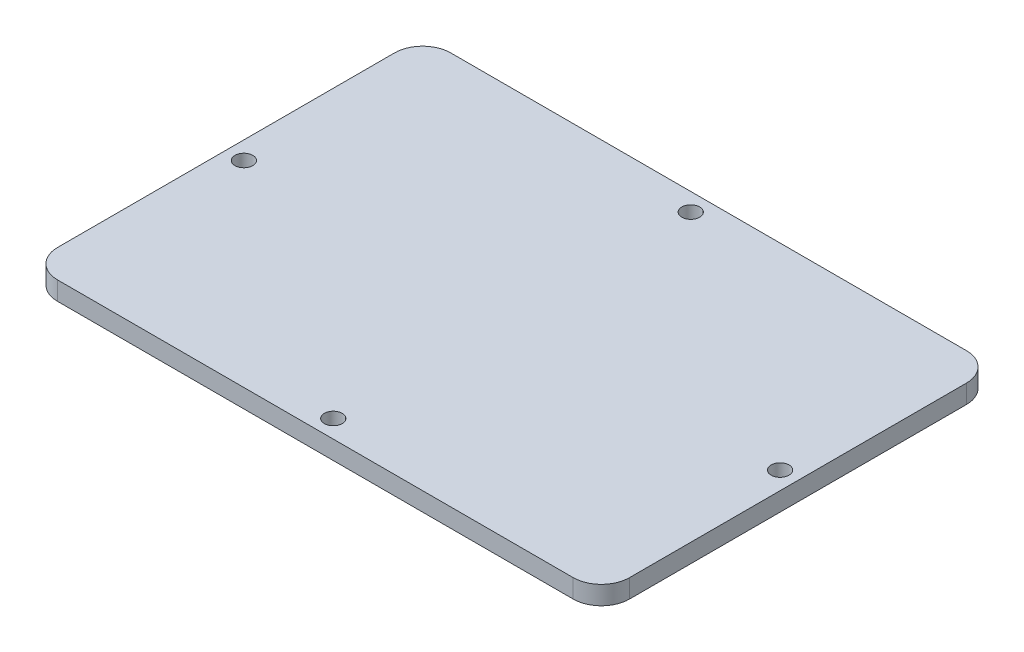
ISO-10303-21;
HEADER;
FILE_DESCRIPTION(('STEP AP214'),'2;1');
FILE_NAME('part.step','',(''),(''),'','','');
FILE_SCHEMA(('AUTOMOTIVE_DESIGN { 1 0 10303 214 1 1 1 1 }'));
ENDSEC;
DATA;
#1=APPLICATION_CONTEXT('core data for automotive mechanical design processes');
#2=APPLICATION_PROTOCOL_DEFINITION('international standard','automotive_design',2000,#1);
#3=PRODUCT_CONTEXT('',#1,'mechanical');
#4=PRODUCT('Part','Part','',(#3));
#5=PRODUCT_RELATED_PRODUCT_CATEGORY('part','',(#4));
#6=PRODUCT_DEFINITION_FORMATION('','',#4);
#7=PRODUCT_DEFINITION_CONTEXT('part definition',#1,'design');
#8=PRODUCT_DEFINITION('design','',#6,#7);
#9=PRODUCT_DEFINITION_SHAPE('','',#8);
#10=(LENGTH_UNIT() NAMED_UNIT(*) SI_UNIT(.MILLI.,.METRE.));
#11=(NAMED_UNIT(*) PLANE_ANGLE_UNIT() SI_UNIT($,.RADIAN.));
#12=(NAMED_UNIT(*) SI_UNIT($,.STERADIAN.) SOLID_ANGLE_UNIT());
#13=UNCERTAINTY_MEASURE_WITH_UNIT(LENGTH_MEASURE(1.E-05),#10,'distance_accuracy_value','');
#14=(GEOMETRIC_REPRESENTATION_CONTEXT(3) GLOBAL_UNCERTAINTY_ASSIGNED_CONTEXT((#13)) GLOBAL_UNIT_ASSIGNED_CONTEXT((#10,
#11,#12)) REPRESENTATION_CONTEXT('',''));
#15=CARTESIAN_POINT('',(0.,0.,0.));
#16=DIRECTION('',(0.,0.,1.));
#17=DIRECTION('',(1.,0.,0.));
#18=AXIS2_PLACEMENT_3D('',#15,#16,#17);
#19=CARTESIAN_POINT('',(50.8,3.302,34.925));
#20=DIRECTION('',(-1.,0.,0.));
#21=DIRECTION('',(0.,0.,1.));
#22=AXIS2_PLACEMENT_3D('',#19,#20,#21);
#23=PLANE('',#22);
#24=DIRECTION('',(0.,0.,-1.));
#25=VECTOR('',#24,1.);
#26=CARTESIAN_POINT('',(50.8,0.,34.925));
#27=LINE('',#26,#25);
#28=CARTESIAN_POINT('',(50.8,0.,29.925));
#29=VERTEX_POINT('',#28);
#30=CARTESIAN_POINT('',(50.8,0.,-29.925));
#31=VERTEX_POINT('',#30);
#32=EDGE_CURVE('E130',#29,#31,#27,.T.);
#33=ORIENTED_EDGE('',*,*,#32,.T.);
#34=DIRECTION('',(0.,-1.,0.));
#35=VECTOR('',#34,1.);
#36=CARTESIAN_POINT('',(50.8,3.302,-29.925));
#37=LINE('',#36,#35);
#38=CARTESIAN_POINT('',(50.8,3.302,-29.925));
#39=VERTEX_POINT('',#38);
#40=EDGE_CURVE('E108',#31,#39,#37,.F.);
#41=ORIENTED_EDGE('',*,*,#40,.T.);
#42=DIRECTION('',(0.,0.,-1.));
#43=VECTOR('',#42,1.);
#44=CARTESIAN_POINT('',(50.8,3.302,34.925));
#45=LINE('',#44,#43);
#46=CARTESIAN_POINT('',(50.8,3.302,29.925));
#47=VERTEX_POINT('',#46);
#48=EDGE_CURVE('E140',#47,#39,#45,.T.);
#49=ORIENTED_EDGE('',*,*,#48,.F.);
#50=DIRECTION('',(0.,-1.,0.));
#51=VECTOR('',#50,1.);
#52=CARTESIAN_POINT('',(50.8,3.302,29.925));
#53=LINE('',#52,#51);
#54=EDGE_CURVE('E113',#47,#29,#53,.T.);
#55=ORIENTED_EDGE('',*,*,#54,.T.);
#56=EDGE_LOOP('',(#33,#41,#49,#55));
#57=FACE_BOUND('',#56,.T.);
#58=ADVANCED_FACE('F37',(#57),#23,.F.);
#59=CARTESIAN_POINT('',(-50.8,3.302,-34.925));
#60=DIRECTION('',(0.,0.,1.));
#61=DIRECTION('',(1.,0.,0.));
#62=AXIS2_PLACEMENT_3D('',#59,#60,#61);
#63=PLANE('',#62);
#64=DIRECTION('',(-1.,0.,0.));
#65=VECTOR('',#64,1.);
#66=CARTESIAN_POINT('',(-50.8,3.302,-34.925));
#67=LINE('',#66,#65);
#68=CARTESIAN_POINT('',(45.8,3.302,-34.925));
#69=VERTEX_POINT('',#68);
#70=CARTESIAN_POINT('',(-45.8,3.302,-34.925));
#71=VERTEX_POINT('',#70);
#72=EDGE_CURVE('E123',#69,#71,#67,.T.);
#73=ORIENTED_EDGE('',*,*,#72,.F.);
#74=DIRECTION('',(0.,-1.,0.));
#75=VECTOR('',#74,1.);
#76=CARTESIAN_POINT('',(45.8,3.302,-34.925));
#77=LINE('',#76,#75);
#78=CARTESIAN_POINT('',(45.8,0.,-34.925));
#79=VERTEX_POINT('',#78);
#80=EDGE_CURVE('E107',#69,#79,#77,.T.);
#81=ORIENTED_EDGE('',*,*,#80,.T.);
#82=DIRECTION('',(-1.,0.,0.));
#83=VECTOR('',#82,1.);
#84=CARTESIAN_POINT('',(-50.8,0.,-34.925));
#85=LINE('',#84,#83);
#86=CARTESIAN_POINT('',(-45.8,0.,-34.925));
#87=VERTEX_POINT('',#86);
#88=EDGE_CURVE('E120',#79,#87,#85,.T.);
#89=ORIENTED_EDGE('',*,*,#88,.T.);
#90=DIRECTION('',(0.,-1.,0.));
#91=VECTOR('',#90,1.);
#92=CARTESIAN_POINT('',(-45.8,3.302,-34.925));
#93=LINE('',#92,#91);
#94=EDGE_CURVE('E125',#87,#71,#93,.F.);
#95=ORIENTED_EDGE('',*,*,#94,.T.);
#96=EDGE_LOOP('',(#73,#81,#89,#95));
#97=FACE_BOUND('',#96,.T.);
#98=ADVANCED_FACE('F119',(#97),#63,.F.);
#99=CARTESIAN_POINT('',(-50.8,3.302,34.925));
#100=DIRECTION('',(1.,0.,0.));
#101=DIRECTION('',(0.,0.,-1.));
#102=AXIS2_PLACEMENT_3D('',#99,#100,#101);
#103=PLANE('',#102);
#104=DIRECTION('',(0.,0.,1.));
#105=VECTOR('',#104,1.);
#106=CARTESIAN_POINT('',(-50.8,0.,34.925));
#107=LINE('',#106,#105);
#108=CARTESIAN_POINT('',(-50.8,0.,-29.925));
#109=VERTEX_POINT('',#108);
#110=CARTESIAN_POINT('',(-50.8,0.,29.925));
#111=VERTEX_POINT('',#110);
#112=EDGE_CURVE('E129',#109,#111,#107,.T.);
#113=ORIENTED_EDGE('',*,*,#112,.T.);
#114=DIRECTION('',(0.,-1.,0.));
#115=VECTOR('',#114,1.);
#116=CARTESIAN_POINT('',(-50.8,3.302,29.925));
#117=LINE('',#116,#115);
#118=CARTESIAN_POINT('',(-50.8,3.302,29.925));
#119=VERTEX_POINT('',#118);
#120=EDGE_CURVE('E11',#111,#119,#117,.F.);
#121=ORIENTED_EDGE('',*,*,#120,.T.);
#122=DIRECTION('',(0.,0.,1.));
#123=VECTOR('',#122,1.);
#124=CARTESIAN_POINT('',(-50.8,3.302,34.925));
#125=LINE('',#124,#123);
#126=CARTESIAN_POINT('',(-50.8,3.302,-29.925));
#127=VERTEX_POINT('',#126);
#128=EDGE_CURVE('E166',#127,#119,#125,.T.);
#129=ORIENTED_EDGE('',*,*,#128,.F.);
#130=DIRECTION('',(0.,-1.,0.));
#131=VECTOR('',#130,1.);
#132=CARTESIAN_POINT('',(-50.8,3.302,-29.925));
#133=LINE('',#132,#131);
#134=EDGE_CURVE('E45',#127,#109,#133,.T.);
#135=ORIENTED_EDGE('',*,*,#134,.T.);
#136=EDGE_LOOP('',(#113,#121,#129,#135));
#137=FACE_BOUND('',#136,.T.);
#138=ADVANCED_FACE('F164',(#137),#103,.F.);
#139=CARTESIAN_POINT('',(-50.8,3.302,34.925));
#140=DIRECTION('',(0.,0.,-1.));
#141=DIRECTION('',(-1.,0.,0.));
#142=AXIS2_PLACEMENT_3D('',#139,#140,#141);
#143=PLANE('',#142);
#144=DIRECTION('',(1.,0.,0.));
#145=VECTOR('',#144,1.);
#146=CARTESIAN_POINT('',(-50.8,0.,34.925));
#147=LINE('',#146,#145);
#148=CARTESIAN_POINT('',(-45.8,0.,34.925));
#149=VERTEX_POINT('',#148);
#150=CARTESIAN_POINT('',(45.8,0.,34.925));
#151=VERTEX_POINT('',#150);
#152=EDGE_CURVE('E133',#149,#151,#147,.T.);
#153=ORIENTED_EDGE('',*,*,#152,.T.);
#154=DIRECTION('',(0.,-1.,0.));
#155=VECTOR('',#154,1.);
#156=CARTESIAN_POINT('',(45.8,3.302,34.925));
#157=LINE('',#156,#155);
#158=CARTESIAN_POINT('',(45.8,3.302,34.925));
#159=VERTEX_POINT('',#158);
#160=EDGE_CURVE('E52',#151,#159,#157,.F.);
#161=ORIENTED_EDGE('',*,*,#160,.T.);
#162=DIRECTION('',(1.,0.,0.));
#163=VECTOR('',#162,1.);
#164=CARTESIAN_POINT('',(-50.8,3.302,34.925));
#165=LINE('',#164,#163);
#166=CARTESIAN_POINT('',(-45.8,3.302,34.925));
#167=VERTEX_POINT('',#166);
#168=EDGE_CURVE('E141',#167,#159,#165,.T.);
#169=ORIENTED_EDGE('',*,*,#168,.F.);
#170=DIRECTION('',(0.,-1.,0.));
#171=VECTOR('',#170,1.);
#172=CARTESIAN_POINT('',(-45.8,3.302,34.925));
#173=LINE('',#172,#171);
#174=EDGE_CURVE('E157',#167,#149,#173,.T.);
#175=ORIENTED_EDGE('',*,*,#174,.T.);
#176=EDGE_LOOP('',(#153,#161,#169,#175));
#177=FACE_BOUND('',#176,.T.);
#178=ADVANCED_FACE('F173',(#177),#143,.F.);
#179=CARTESIAN_POINT('',(0.,3.302,0.));
#180=DIRECTION('',(0.,-1.,0.));
#181=DIRECTION('',(0.,0.,-1.));
#182=AXIS2_PLACEMENT_3D('',#179,#180,#181);
#183=PLANE('',#182);
#184=CARTESIAN_POINT('',(0.,3.302,-31.75));
#185=DIRECTION('',(0.,-1.,0.));
#186=DIRECTION('',(0.,0.,-1.));
#187=AXIS2_PLACEMENT_3D('',#184,#185,#186);
#188=CIRCLE('',#187,1.5875);
#189=CARTESIAN_POINT('',(0.,3.302,-33.3375));
#190=VERTEX_POINT('',#189);
#191=EDGE_CURVE('E135',#190,#190,#188,.T.);
#192=ORIENTED_EDGE('',*,*,#191,.T.);
#193=EDGE_LOOP('',(#192));
#194=FACE_BOUND('',#193,.T.);
#195=CARTESIAN_POINT('',(47.625,3.302,0.));
#196=DIRECTION('',(0.,-1.,0.));
#197=DIRECTION('',(0.,0.,-1.));
#198=AXIS2_PLACEMENT_3D('',#195,#196,#197);
#199=CIRCLE('',#198,1.5875);
#200=CARTESIAN_POINT('',(47.625,3.302,-1.58749999999999));
#201=VERTEX_POINT('',#200);
#202=EDGE_CURVE('E195',#201,#201,#199,.T.);
#203=ORIENTED_EDGE('',*,*,#202,.T.);
#204=EDGE_LOOP('',(#203));
#205=FACE_BOUND('',#204,.T.);
#206=CARTESIAN_POINT('',(0.,3.302,31.75));
#207=DIRECTION('',(0.,-1.,0.));
#208=DIRECTION('',(0.,0.,-1.));
#209=AXIS2_PLACEMENT_3D('',#206,#207,#208);
#210=CIRCLE('',#209,1.5875);
#211=CARTESIAN_POINT('',(0.,3.302,30.1625));
#212=VERTEX_POINT('',#211);
#213=EDGE_CURVE('E189',#212,#212,#210,.T.);
#214=ORIENTED_EDGE('',*,*,#213,.T.);
#215=EDGE_LOOP('',(#214));
#216=FACE_BOUND('',#215,.T.);
#217=CARTESIAN_POINT('',(-47.625,3.302,0.));
#218=DIRECTION('',(0.,-1.,0.));
#219=DIRECTION('',(0.,0.,-1.));
#220=AXIS2_PLACEMENT_3D('',#217,#218,#219);
#221=CIRCLE('',#220,1.5875);
#222=CARTESIAN_POINT('',(-47.625,3.302,-1.58750000000001));
#223=VERTEX_POINT('',#222);
#224=EDGE_CURVE('E183',#223,#223,#221,.T.);
#225=ORIENTED_EDGE('',*,*,#224,.T.);
#226=EDGE_LOOP('',(#225));
#227=FACE_BOUND('',#226,.T.);
#228=ORIENTED_EDGE('',*,*,#48,.T.);
#229=CARTESIAN_POINT('',(45.8,3.302,-29.925));
#230=DIRECTION('',(0.,-1.,0.));
#231=DIRECTION('',(0.,0.,-1.));
#232=AXIS2_PLACEMENT_3D('',#229,#230,#231);
#233=CIRCLE('',#232,5.);
#234=EDGE_CURVE('E155',#39,#69,#233,.F.);
#235=ORIENTED_EDGE('',*,*,#234,.T.);
#236=ORIENTED_EDGE('',*,*,#72,.T.);
#237=CARTESIAN_POINT('',(-45.8,3.302,-29.925));
#238=DIRECTION('',(0.,-1.,0.));
#239=DIRECTION('',(0.,0.,-1.));
#240=AXIS2_PLACEMENT_3D('',#237,#238,#239);
#241=CIRCLE('',#240,5.);
#242=EDGE_CURVE('E150',#71,#127,#241,.F.);
#243=ORIENTED_EDGE('',*,*,#242,.T.);
#244=ORIENTED_EDGE('',*,*,#128,.T.);
#245=CARTESIAN_POINT('',(-45.8,3.302,29.925));
#246=DIRECTION('',(0.,-1.,0.));
#247=DIRECTION('',(0.,0.,-1.));
#248=AXIS2_PLACEMENT_3D('',#245,#246,#247);
#249=CIRCLE('',#248,5.);
#250=EDGE_CURVE('E59',#119,#167,#249,.F.);
#251=ORIENTED_EDGE('',*,*,#250,.T.);
#252=ORIENTED_EDGE('',*,*,#168,.T.);
#253=CARTESIAN_POINT('',(45.8,3.302,29.925));
#254=DIRECTION('',(0.,-1.,0.));
#255=DIRECTION('',(0.,0.,-1.));
#256=AXIS2_PLACEMENT_3D('',#253,#254,#255);
#257=CIRCLE('',#256,5.);
#258=EDGE_CURVE('E153',#159,#47,#257,.F.);
#259=ORIENTED_EDGE('',*,*,#258,.T.);
#260=EDGE_LOOP('',(#228,#235,#236,#243,#244,#251,#252,#259));
#261=FACE_BOUND('',#260,.T.);
#262=ADVANCED_FACE('F204',(#194,#205,#216,#227,#261),#183,.F.);
#263=CARTESIAN_POINT('',(0.,0.,0.));
#264=DIRECTION('',(0.,-1.,0.));
#265=DIRECTION('',(0.,0.,-1.));
#266=AXIS2_PLACEMENT_3D('',#263,#264,#265);
#267=PLANE('',#266);
#268=CARTESIAN_POINT('',(0.,0.,-31.75));
#269=DIRECTION('',(0.,-1.,0.));
#270=DIRECTION('',(0.,0.,-1.));
#271=AXIS2_PLACEMENT_3D('',#268,#269,#270);
#272=CIRCLE('',#271,1.5875);
#273=CARTESIAN_POINT('',(0.,0.,-33.3375));
#274=VERTEX_POINT('',#273);
#275=EDGE_CURVE('E198',#274,#274,#272,.T.);
#276=ORIENTED_EDGE('',*,*,#275,.F.);
#277=EDGE_LOOP('',(#276));
#278=FACE_BOUND('',#277,.T.);
#279=CARTESIAN_POINT('',(47.625,0.,0.));
#280=DIRECTION('',(0.,-1.,0.));
#281=DIRECTION('',(0.,0.,-1.));
#282=AXIS2_PLACEMENT_3D('',#279,#280,#281);
#283=CIRCLE('',#282,1.5875);
#284=CARTESIAN_POINT('',(47.625,0.,-1.58749999999999));
#285=VERTEX_POINT('',#284);
#286=EDGE_CURVE('E192',#285,#285,#283,.T.);
#287=ORIENTED_EDGE('',*,*,#286,.F.);
#288=EDGE_LOOP('',(#287));
#289=FACE_BOUND('',#288,.T.);
#290=CARTESIAN_POINT('',(0.,0.,31.75));
#291=DIRECTION('',(0.,-1.,0.));
#292=DIRECTION('',(0.,0.,-1.));
#293=AXIS2_PLACEMENT_3D('',#290,#291,#292);
#294=CIRCLE('',#293,1.5875);
#295=CARTESIAN_POINT('',(0.,0.,30.1625));
#296=VERTEX_POINT('',#295);
#297=EDGE_CURVE('E186',#296,#296,#294,.T.);
#298=ORIENTED_EDGE('',*,*,#297,.F.);
#299=EDGE_LOOP('',(#298));
#300=FACE_BOUND('',#299,.T.);
#301=CARTESIAN_POINT('',(-47.625,0.,0.));
#302=DIRECTION('',(0.,-1.,0.));
#303=DIRECTION('',(0.,0.,-1.));
#304=AXIS2_PLACEMENT_3D('',#301,#302,#303);
#305=CIRCLE('',#304,1.5875);
#306=CARTESIAN_POINT('',(-47.625,0.,-1.58750000000001));
#307=VERTEX_POINT('',#306);
#308=EDGE_CURVE('E180',#307,#307,#305,.T.);
#309=ORIENTED_EDGE('',*,*,#308,.F.);
#310=EDGE_LOOP('',(#309));
#311=FACE_BOUND('',#310,.T.);
#312=ORIENTED_EDGE('',*,*,#88,.F.);
#313=CARTESIAN_POINT('',(45.8,0.,-29.925));
#314=DIRECTION('',(0.,-1.,0.));
#315=DIRECTION('',(0.,0.,-1.));
#316=AXIS2_PLACEMENT_3D('',#313,#314,#315);
#317=CIRCLE('',#316,5.);
#318=EDGE_CURVE('E103',#79,#31,#317,.T.);
#319=ORIENTED_EDGE('',*,*,#318,.T.);
#320=ORIENTED_EDGE('',*,*,#32,.F.);
#321=CARTESIAN_POINT('',(45.8,0.,29.925));
#322=DIRECTION('',(0.,-1.,0.));
#323=DIRECTION('',(0.,0.,-1.));
#324=AXIS2_PLACEMENT_3D('',#321,#322,#323);
#325=CIRCLE('',#324,5.);
#326=EDGE_CURVE('E114',#29,#151,#325,.T.);
#327=ORIENTED_EDGE('',*,*,#326,.T.);
#328=ORIENTED_EDGE('',*,*,#152,.F.);
#329=CARTESIAN_POINT('',(-45.8,0.,29.925));
#330=DIRECTION('',(0.,-1.,0.));
#331=DIRECTION('',(0.,0.,-1.));
#332=AXIS2_PLACEMENT_3D('',#329,#330,#331);
#333=CIRCLE('',#332,5.);
#334=EDGE_CURVE('E144',#149,#111,#333,.T.);
#335=ORIENTED_EDGE('',*,*,#334,.T.);
#336=ORIENTED_EDGE('',*,*,#112,.F.);
#337=CARTESIAN_POINT('',(-45.8,0.,-29.925));
#338=DIRECTION('',(0.,-1.,0.));
#339=DIRECTION('',(0.,0.,-1.));
#340=AXIS2_PLACEMENT_3D('',#337,#338,#339);
#341=CIRCLE('',#340,5.);
#342=EDGE_CURVE('E124',#109,#87,#341,.T.);
#343=ORIENTED_EDGE('',*,*,#342,.T.);
#344=EDGE_LOOP('',(#312,#319,#320,#327,#328,#335,#336,#343));
#345=FACE_BOUND('',#344,.T.);
#346=ADVANCED_FACE('F127',(#278,#289,#300,#311,#345),#267,.T.);
#347=CARTESIAN_POINT('',(-47.625,3.302,0.));
#348=DIRECTION('',(0.,-1.,0.));
#349=DIRECTION('',(0.,0.,-1.));
#350=AXIS2_PLACEMENT_3D('',#347,#348,#349);
#351=CYLINDRICAL_SURFACE('',#350,1.5875);
#352=ORIENTED_EDGE('',*,*,#224,.F.);
#353=EDGE_LOOP('',(#352));
#354=FACE_BOUND('',#353,.T.);
#355=ORIENTED_EDGE('',*,*,#308,.T.);
#356=EDGE_LOOP('',(#355));
#357=FACE_BOUND('',#356,.T.);
#358=ADVANCED_FACE('F216',(#354,#357),#351,.F.);
#359=CARTESIAN_POINT('',(0.,3.302,31.75));
#360=DIRECTION('',(0.,-1.,0.));
#361=DIRECTION('',(0.,0.,-1.));
#362=AXIS2_PLACEMENT_3D('',#359,#360,#361);
#363=CYLINDRICAL_SURFACE('',#362,1.5875);
#364=ORIENTED_EDGE('',*,*,#213,.F.);
#365=EDGE_LOOP('',(#364));
#366=FACE_BOUND('',#365,.T.);
#367=ORIENTED_EDGE('',*,*,#297,.T.);
#368=EDGE_LOOP('',(#367));
#369=FACE_BOUND('',#368,.T.);
#370=ADVANCED_FACE('F225',(#366,#369),#363,.F.);
#371=CARTESIAN_POINT('',(47.625,3.302,0.));
#372=DIRECTION('',(0.,-1.,0.));
#373=DIRECTION('',(0.,0.,-1.));
#374=AXIS2_PLACEMENT_3D('',#371,#372,#373);
#375=CYLINDRICAL_SURFACE('',#374,1.5875);
#376=ORIENTED_EDGE('',*,*,#202,.F.);
#377=EDGE_LOOP('',(#376));
#378=FACE_BOUND('',#377,.T.);
#379=ORIENTED_EDGE('',*,*,#286,.T.);
#380=EDGE_LOOP('',(#379));
#381=FACE_BOUND('',#380,.T.);
#382=ADVANCED_FACE('F210',(#378,#381),#375,.F.);
#383=CARTESIAN_POINT('',(0.,3.302,-31.75));
#384=DIRECTION('',(0.,-1.,0.));
#385=DIRECTION('',(0.,0.,-1.));
#386=AXIS2_PLACEMENT_3D('',#383,#384,#385);
#387=CYLINDRICAL_SURFACE('',#386,1.5875);
#388=ORIENTED_EDGE('',*,*,#191,.F.);
#389=EDGE_LOOP('',(#388));
#390=FACE_BOUND('',#389,.T.);
#391=ORIENTED_EDGE('',*,*,#275,.T.);
#392=EDGE_LOOP('',(#391));
#393=FACE_BOUND('',#392,.T.);
#394=ADVANCED_FACE('F207',(#390,#393),#387,.F.);
#395=CARTESIAN_POINT('',(45.8,3.302,-29.925));
#396=DIRECTION('',(0.,-1.,0.));
#397=DIRECTION('',(0.,0.,-1.));
#398=AXIS2_PLACEMENT_3D('',#395,#396,#397);
#399=CYLINDRICAL_SURFACE('',#398,5.);
#400=ORIENTED_EDGE('',*,*,#234,.F.);
#401=ORIENTED_EDGE('',*,*,#40,.F.);
#402=ORIENTED_EDGE('',*,*,#318,.F.);
#403=ORIENTED_EDGE('',*,*,#80,.F.);
#404=EDGE_LOOP('',(#400,#401,#402,#403));
#405=FACE_BOUND('',#404,.T.);
#406=ADVANCED_FACE('F106',(#405),#399,.T.);
#407=CARTESIAN_POINT('',(45.8,3.302,29.925));
#408=DIRECTION('',(0.,-1.,0.));
#409=DIRECTION('',(0.,0.,-1.));
#410=AXIS2_PLACEMENT_3D('',#407,#408,#409);
#411=CYLINDRICAL_SURFACE('',#410,5.);
#412=ORIENTED_EDGE('',*,*,#258,.F.);
#413=ORIENTED_EDGE('',*,*,#160,.F.);
#414=ORIENTED_EDGE('',*,*,#326,.F.);
#415=ORIENTED_EDGE('',*,*,#54,.F.);
#416=EDGE_LOOP('',(#412,#413,#414,#415));
#417=FACE_BOUND('',#416,.T.);
#418=ADVANCED_FACE('F246',(#417),#411,.T.);
#419=CARTESIAN_POINT('',(-45.8,3.302,29.925));
#420=DIRECTION('',(0.,-1.,0.));
#421=DIRECTION('',(0.,0.,-1.));
#422=AXIS2_PLACEMENT_3D('',#419,#420,#421);
#423=CYLINDRICAL_SURFACE('',#422,5.);
#424=ORIENTED_EDGE('',*,*,#250,.F.);
#425=ORIENTED_EDGE('',*,*,#120,.F.);
#426=ORIENTED_EDGE('',*,*,#334,.F.);
#427=ORIENTED_EDGE('',*,*,#174,.F.);
#428=EDGE_LOOP('',(#424,#425,#426,#427));
#429=FACE_BOUND('',#428,.T.);
#430=ADVANCED_FACE('F172',(#429),#423,.T.);
#431=CARTESIAN_POINT('',(-45.8,3.302,-29.925));
#432=DIRECTION('',(0.,-1.,0.));
#433=DIRECTION('',(0.,0.,-1.));
#434=AXIS2_PLACEMENT_3D('',#431,#432,#433);
#435=CYLINDRICAL_SURFACE('',#434,5.);
#436=ORIENTED_EDGE('',*,*,#242,.F.);
#437=ORIENTED_EDGE('',*,*,#94,.F.);
#438=ORIENTED_EDGE('',*,*,#342,.F.);
#439=ORIENTED_EDGE('',*,*,#134,.F.);
#440=EDGE_LOOP('',(#436,#437,#438,#439));
#441=FACE_BOUND('',#440,.T.);
#442=ADVANCED_FACE('F39',(#441),#435,.T.);
#443=CLOSED_SHELL('',(#58,#98,#138,#178,#262,#346,#358,#370,#382,#394,#406,#418,#430,#442));
#444=MANIFOLD_SOLID_BREP('B2',#443);
#445=ADVANCED_BREP_SHAPE_REPRESENTATION('',(#18,#444),#14);
#446=SHAPE_DEFINITION_REPRESENTATION(#9,#445);
ENDSEC;
END-ISO-10303-21;
